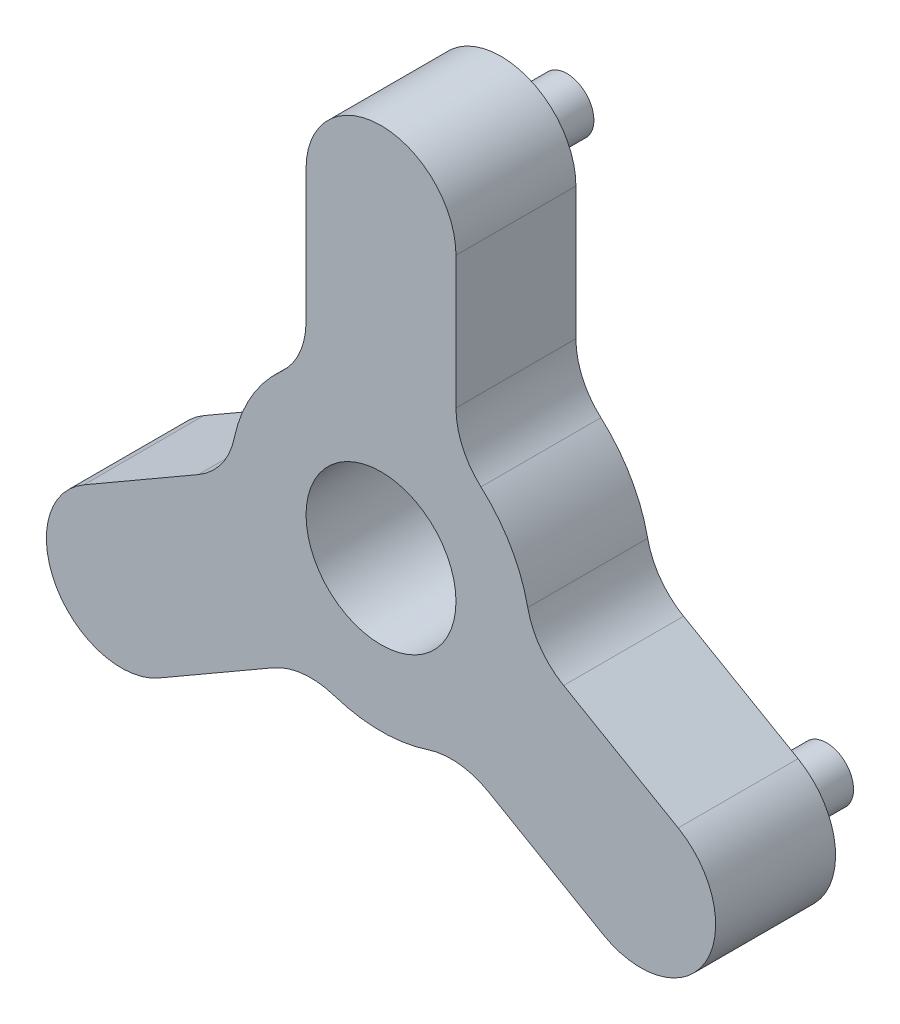
ISO-10303-21;
HEADER;
FILE_DESCRIPTION(('STEP AP214'),'2;1');
FILE_NAME('part.step','',(''),(''),'','','');
FILE_SCHEMA(('AUTOMOTIVE_DESIGN { 1 0 10303 214 1 1 1 1 }'));
ENDSEC;
DATA;
#1=APPLICATION_CONTEXT('core data for automotive mechanical design processes');
#2=APPLICATION_PROTOCOL_DEFINITION('international standard','automotive_design',2000,#1);
#3=PRODUCT_CONTEXT('',#1,'mechanical');
#4=PRODUCT('Part','Part','',(#3));
#5=PRODUCT_RELATED_PRODUCT_CATEGORY('part','',(#4));
#6=PRODUCT_DEFINITION_FORMATION('','',#4);
#7=PRODUCT_DEFINITION_CONTEXT('part definition',#1,'design');
#8=PRODUCT_DEFINITION('design','',#6,#7);
#9=PRODUCT_DEFINITION_SHAPE('','',#8);
#10=(LENGTH_UNIT() NAMED_UNIT(*) SI_UNIT(.MILLI.,.METRE.));
#11=(NAMED_UNIT(*) PLANE_ANGLE_UNIT() SI_UNIT($,.RADIAN.));
#12=(NAMED_UNIT(*) SI_UNIT($,.STERADIAN.) SOLID_ANGLE_UNIT());
#13=UNCERTAINTY_MEASURE_WITH_UNIT(LENGTH_MEASURE(1.E-05),#10,'distance_accuracy_value','');
#14=(GEOMETRIC_REPRESENTATION_CONTEXT(3) GLOBAL_UNCERTAINTY_ASSIGNED_CONTEXT((#13)) GLOBAL_UNIT_ASSIGNED_CONTEXT((#10,
#11,#12)) REPRESENTATION_CONTEXT('',''));
#15=CARTESIAN_POINT('',(0.,0.,0.));
#16=DIRECTION('',(0.,0.,1.));
#17=DIRECTION('',(1.,0.,0.));
#18=AXIS2_PLACEMENT_3D('',#15,#16,#17);
#19=CARTESIAN_POINT('',(0.,44.45,14.1140775589406));
#20=DIRECTION('',(0.,0.,-1.));
#21=DIRECTION('',(-1.,0.,0.));
#22=AXIS2_PLACEMENT_3D('',#19,#20,#21);
#23=CYLINDRICAL_SURFACE('',#22,11.1125);
#24=CARTESIAN_POINT('',(0.,44.45,-3.66592244105941));
#25=DIRECTION('',(0.,0.,1.));
#26=DIRECTION('',(1.,0.,0.));
#27=AXIS2_PLACEMENT_3D('',#24,#25,#26);
#28=CIRCLE('',#27,11.1125);
#29=CARTESIAN_POINT('',(11.1125,44.45,-3.66592244105941));
#30=VERTEX_POINT('',#29);
#31=CARTESIAN_POINT('',(-11.1125,44.45,-3.66592244105941));
#32=VERTEX_POINT('',#31);
#33=EDGE_CURVE('E192',#30,#32,#28,.T.);
#34=ORIENTED_EDGE('',*,*,#33,.T.);
#35=DIRECTION('',(0.,0.,-1.));
#36=VECTOR('',#35,1.);
#37=CARTESIAN_POINT('',(-11.1125,44.45,14.1140775589406));
#38=LINE('',#37,#36);
#39=CARTESIAN_POINT('',(-11.1125,44.45,14.1140775589406));
#40=VERTEX_POINT('',#39);
#41=EDGE_CURVE('E270',#40,#32,#38,.T.);
#42=ORIENTED_EDGE('',*,*,#41,.F.);
#43=CARTESIAN_POINT('',(0.,44.45,14.1140775589406));
#44=DIRECTION('',(0.,0.,1.));
#45=DIRECTION('',(1.,0.,0.));
#46=AXIS2_PLACEMENT_3D('',#43,#44,#45);
#47=CIRCLE('',#46,11.1125);
#48=CARTESIAN_POINT('',(11.1125,44.45,14.1140775589406));
#49=VERTEX_POINT('',#48);
#50=EDGE_CURVE('E227',#49,#40,#47,.T.);
#51=ORIENTED_EDGE('',*,*,#50,.F.);
#52=DIRECTION('',(0.,0.,-1.));
#53=VECTOR('',#52,1.);
#54=CARTESIAN_POINT('',(11.1125,44.45,14.1140775589406));
#55=LINE('',#54,#53);
#56=EDGE_CURVE('E188',#49,#30,#55,.T.);
#57=ORIENTED_EDGE('',*,*,#56,.T.);
#58=EDGE_LOOP('',(#34,#42,#51,#57));
#59=FACE_BOUND('',#58,.T.);
#60=ADVANCED_FACE('F35',(#59),#23,.T.);
#61=CARTESIAN_POINT('',(-11.1125,44.45,14.1140775589406));
#62=DIRECTION('',(1.,0.,0.));
#63=DIRECTION('',(0.,1.,0.));
#64=AXIS2_PLACEMENT_3D('',#61,#62,#63);
#65=PLANE('',#64);
#66=DIRECTION('',(0.,-1.,0.));
#67=VECTOR('',#66,1.);
#68=CARTESIAN_POINT('',(-11.1125,44.45,-3.66592244105941));
#69=LINE('',#68,#67);
#70=CARTESIAN_POINT('',(-11.1125,24.8483053999664,-3.66592244105941));
#71=VERTEX_POINT('',#70);
#72=EDGE_CURVE('E195',#32,#71,#69,.T.);
#73=ORIENTED_EDGE('',*,*,#72,.T.);
#74=DIRECTION('',(0.,0.,-1.));
#75=VECTOR('',#74,1.);
#76=CARTESIAN_POINT('',(-11.1125,24.8483053999664,14.1140775589406));
#77=LINE('',#76,#75);
#78=CARTESIAN_POINT('',(-11.1125,24.8483053999664,14.1140775589406));
#79=VERTEX_POINT('',#78);
#80=EDGE_CURVE('E267',#79,#71,#77,.T.);
#81=ORIENTED_EDGE('',*,*,#80,.F.);
#82=DIRECTION('',(0.,-1.,0.));
#83=VECTOR('',#82,1.);
#84=CARTESIAN_POINT('',(-11.1125,44.45,14.1140775589406));
#85=LINE('',#84,#83);
#86=EDGE_CURVE('E125',#40,#79,#85,.T.);
#87=ORIENTED_EDGE('',*,*,#86,.F.);
#88=ORIENTED_EDGE('',*,*,#41,.T.);
#89=EDGE_LOOP('',(#73,#81,#87,#88));
#90=FACE_BOUND('',#89,.T.);
#91=ADVANCED_FACE('F303',(#90),#65,.F.);
#92=CARTESIAN_POINT('',(-22.225,24.8483053999664,14.1140775589406));
#93=DIRECTION('',(0.,0.,-1.));
#94=DIRECTION('',(-1.,0.,0.));
#95=AXIS2_PLACEMENT_3D('',#92,#93,#94);
#96=CYLINDRICAL_SURFACE('',#95,11.1125);
#97=CARTESIAN_POINT('',(-22.225,24.8483053999664,-3.66592244105941));
#98=DIRECTION('',(0.,0.,-1.));
#99=DIRECTION('',(-1.,0.,0.));
#100=AXIS2_PLACEMENT_3D('',#97,#98,#99);
#101=CIRCLE('',#100,11.1125);
#102=CARTESIAN_POINT('',(-14.8166666666667,16.565536933311,-3.66592244105941));
#103=VERTEX_POINT('',#102);
#104=EDGE_CURVE('E198',#71,#103,#101,.T.);
#105=ORIENTED_EDGE('',*,*,#104,.T.);
#106=DIRECTION('',(0.,0.,-1.));
#107=VECTOR('',#106,1.);
#108=CARTESIAN_POINT('',(-14.8166666666667,16.565536933311,14.1140775589406));
#109=LINE('',#108,#107);
#110=CARTESIAN_POINT('',(-14.8166666666667,16.565536933311,14.1140775589406));
#111=VERTEX_POINT('',#110);
#112=EDGE_CURVE('E264',#111,#103,#109,.T.);
#113=ORIENTED_EDGE('',*,*,#112,.F.);
#114=CARTESIAN_POINT('',(-22.225,24.8483053999664,14.1140775589406));
#115=DIRECTION('',(0.,0.,-1.));
#116=DIRECTION('',(-1.,0.,0.));
#117=AXIS2_PLACEMENT_3D('',#114,#115,#116);
#118=CIRCLE('',#117,11.1125);
#119=EDGE_CURVE('E479',#79,#111,#118,.T.);
#120=ORIENTED_EDGE('',*,*,#119,.F.);
#121=ORIENTED_EDGE('',*,*,#80,.T.);
#122=EDGE_LOOP('',(#105,#113,#120,#121));
#123=FACE_BOUND('',#122,.T.);
#124=ADVANCED_FACE('F307',(#123),#96,.F.);
#125=CARTESIAN_POINT('',(0.,0.,14.1140775589406));
#126=DIRECTION('',(0.,0.,-1.));
#127=DIRECTION('',(-1.,0.,0.));
#128=AXIS2_PLACEMENT_3D('',#125,#126,#127);
#129=CYLINDRICAL_SURFACE('',#128,22.225);
#130=CARTESIAN_POINT('',(0.,0.,-3.66592244105941));
#131=DIRECTION('',(0.,0.,1.));
#132=DIRECTION('',(1.,0.,0.));
#133=AXIS2_PLACEMENT_3D('',#130,#131,#132);
#134=CIRCLE('',#133,22.225);
#135=CARTESIAN_POINT('',(-21.75450914491,4.54884126608397,-3.66592244105941));
#136=VERTEX_POINT('',#135);
#137=EDGE_CURVE('E200',#103,#136,#134,.T.);
#138=ORIENTED_EDGE('',*,*,#137,.T.);
#139=DIRECTION('',(0.,0.,-1.));
#140=VECTOR('',#139,1.);
#141=CARTESIAN_POINT('',(-21.75450914491,4.54884126608397,14.1140775589406));
#142=LINE('',#141,#140);
#143=CARTESIAN_POINT('',(-21.75450914491,4.54884126608397,14.1140775589406));
#144=VERTEX_POINT('',#143);
#145=EDGE_CURVE('E261',#144,#136,#142,.T.);
#146=ORIENTED_EDGE('',*,*,#145,.F.);
#147=CARTESIAN_POINT('',(0.,0.,14.1140775589406));
#148=DIRECTION('',(0.,0.,1.));
#149=DIRECTION('',(1.,0.,0.));
#150=AXIS2_PLACEMENT_3D('',#147,#148,#149);
#151=CIRCLE('',#150,22.225);
#152=EDGE_CURVE('E481',#111,#144,#151,.T.);
#153=ORIENTED_EDGE('',*,*,#152,.F.);
#154=ORIENTED_EDGE('',*,*,#112,.T.);
#155=EDGE_LOOP('',(#138,#146,#153,#154));
#156=FACE_BOUND('',#155,.T.);
#157=ADVANCED_FACE('F311',(#156),#129,.T.);
#158=CARTESIAN_POINT('',(-32.631763717365,6.82326189912595,14.1140775589406));
#159=DIRECTION('',(0.,0.,-1.));
#160=DIRECTION('',(-1.,0.,0.));
#161=AXIS2_PLACEMENT_3D('',#158,#159,#160);
#162=CYLINDRICAL_SURFACE('',#161,11.1125);
#163=CARTESIAN_POINT('',(-32.631763717365,6.82326189912595,-3.66592244105941));
#164=DIRECTION('',(0.,0.,-1.));
#165=DIRECTION('',(1.,0.,0.));
#166=AXIS2_PLACEMENT_3D('',#163,#164,#165);
#167=CIRCLE('',#166,11.1125);
#168=CARTESIAN_POINT('',(-27.075513717365,-2.80044540042862,-3.66592244105941));
#169=VERTEX_POINT('',#168);
#170=EDGE_CURVE('E202',#136,#169,#167,.T.);
#171=ORIENTED_EDGE('',*,*,#170,.T.);
#172=DIRECTION('',(0.,0.,-1.));
#173=VECTOR('',#172,1.);
#174=CARTESIAN_POINT('',(-27.075513717365,-2.80044540042862,14.1140775589406));
#175=LINE('',#174,#173);
#176=CARTESIAN_POINT('',(-27.075513717365,-2.80044540042862,14.1140775589406));
#177=VERTEX_POINT('',#176);
#178=EDGE_CURVE('E258',#177,#169,#175,.T.);
#179=ORIENTED_EDGE('',*,*,#178,.F.);
#180=CARTESIAN_POINT('',(-32.631763717365,6.82326189912595,14.1140775589406));
#181=DIRECTION('',(0.,0.,-1.));
#182=DIRECTION('',(1.,0.,0.));
#183=AXIS2_PLACEMENT_3D('',#180,#181,#182);
#184=CIRCLE('',#183,11.1125);
#185=EDGE_CURVE('E483',#144,#177,#184,.T.);
#186=ORIENTED_EDGE('',*,*,#185,.F.);
#187=ORIENTED_EDGE('',*,*,#145,.T.);
#188=EDGE_LOOP('',(#171,#179,#186,#187));
#189=FACE_BOUND('',#188,.T.);
#190=ADVANCED_FACE('F317',(#189),#162,.F.);
#191=CARTESIAN_POINT('',(-44.0510791982183,-12.6012927004454,14.1140775589406));
#192=DIRECTION('',(0.5,-0.866025403784438,0.));
#193=DIRECTION('',(0.866025403784438,0.500000000000001,0.));
#194=AXIS2_PLACEMENT_3D('',#191,#192,#193);
#195=PLANE('',#194);
#196=DIRECTION('',(-0.866025403784438,-0.5,0.));
#197=VECTOR('',#196,1.);
#198=CARTESIAN_POINT('',(-44.0510791982183,-12.6012927004454,-3.66592244105941));
#199=LINE('',#198,#197);
#200=CARTESIAN_POINT('',(-44.0510791982183,-12.6012927004454,-3.66592244105941));
#201=VERTEX_POINT('',#200);
#202=EDGE_CURVE('E204',#169,#201,#199,.T.);
#203=ORIENTED_EDGE('',*,*,#202,.T.);
#204=DIRECTION('',(0.,0.,-1.));
#205=VECTOR('',#204,1.);
#206=CARTESIAN_POINT('',(-44.0510791982183,-12.6012927004454,14.1140775589406));
#207=LINE('',#206,#205);
#208=CARTESIAN_POINT('',(-44.0510791982183,-12.6012927004454,14.1140775589406));
#209=VERTEX_POINT('',#208);
#210=EDGE_CURVE('E255',#209,#201,#207,.T.);
#211=ORIENTED_EDGE('',*,*,#210,.F.);
#212=DIRECTION('',(-0.866025403784438,-0.5,0.));
#213=VECTOR('',#212,1.);
#214=CARTESIAN_POINT('',(-44.0510791982183,-12.6012927004454,14.1140775589406));
#215=LINE('',#214,#213);
#216=EDGE_CURVE('E485',#177,#209,#215,.T.);
#217=ORIENTED_EDGE('',*,*,#216,.F.);
#218=ORIENTED_EDGE('',*,*,#178,.T.);
#219=EDGE_LOOP('',(#203,#211,#217,#218));
#220=FACE_BOUND('',#219,.T.);
#221=ADVANCED_FACE('F321',(#220),#195,.F.);
#222=CARTESIAN_POINT('',(-38.4948291982183,-22.225,14.1140775589406));
#223=DIRECTION('',(0.,0.,-1.));
#224=DIRECTION('',(-1.,0.,0.));
#225=AXIS2_PLACEMENT_3D('',#222,#223,#224);
#226=CYLINDRICAL_SURFACE('',#225,11.1125);
#227=CARTESIAN_POINT('',(-38.4948291982183,-22.225,-3.66592244105941));
#228=DIRECTION('',(0.,0.,1.));
#229=DIRECTION('',(1.,0.,0.));
#230=AXIS2_PLACEMENT_3D('',#227,#228,#229);
#231=CIRCLE('',#230,11.1125);
#232=CARTESIAN_POINT('',(-32.9385791982183,-31.8487072995546,-3.66592244105941));
#233=VERTEX_POINT('',#232);
#234=EDGE_CURVE('E206',#201,#233,#231,.T.);
#235=ORIENTED_EDGE('',*,*,#234,.T.);
#236=DIRECTION('',(0.,0.,-1.));
#237=VECTOR('',#236,1.);
#238=CARTESIAN_POINT('',(-32.9385791982183,-31.8487072995546,14.1140775589406));
#239=LINE('',#238,#237);
#240=CARTESIAN_POINT('',(-32.9385791982183,-31.8487072995546,14.1140775589406));
#241=VERTEX_POINT('',#240);
#242=EDGE_CURVE('E252',#241,#233,#239,.T.);
#243=ORIENTED_EDGE('',*,*,#242,.F.);
#244=CARTESIAN_POINT('',(-38.4948291982183,-22.225,14.1140775589406));
#245=DIRECTION('',(0.,0.,1.));
#246=DIRECTION('',(1.,0.,0.));
#247=AXIS2_PLACEMENT_3D('',#244,#245,#246);
#248=CIRCLE('',#247,11.1125);
#249=EDGE_CURVE('E487',#209,#241,#248,.T.);
#250=ORIENTED_EDGE('',*,*,#249,.F.);
#251=ORIENTED_EDGE('',*,*,#210,.T.);
#252=EDGE_LOOP('',(#235,#243,#250,#251));
#253=FACE_BOUND('',#252,.T.);
#254=ADVANCED_FACE('F325',(#253),#226,.T.);
#255=CARTESIAN_POINT('',(-32.9385791982183,-31.8487072995546,14.1140775589406));
#256=DIRECTION('',(-0.500000000000001,0.866025403784438,0.));
#257=DIRECTION('',(-0.866025403784438,-0.500000000000001,0.));
#258=AXIS2_PLACEMENT_3D('',#255,#256,#257);
#259=PLANE('',#258);
#260=DIRECTION('',(0.866025403784438,0.500000000000001,0.));
#261=VECTOR('',#260,1.);
#262=CARTESIAN_POINT('',(-32.9385791982183,-31.8487072995546,-3.66592244105941));
#263=LINE('',#262,#261);
#264=CARTESIAN_POINT('',(-15.963013717365,-22.0478599995378,-3.66592244105941));
#265=VERTEX_POINT('',#264);
#266=EDGE_CURVE('E208',#233,#265,#263,.T.);
#267=ORIENTED_EDGE('',*,*,#266,.T.);
#268=DIRECTION('',(0.,0.,-1.));
#269=VECTOR('',#268,1.);
#270=CARTESIAN_POINT('',(-15.963013717365,-22.0478599995378,14.1140775589406));
#271=LINE('',#270,#269);
#272=CARTESIAN_POINT('',(-15.963013717365,-22.0478599995378,14.1140775589406));
#273=VERTEX_POINT('',#272);
#274=EDGE_CURVE('E249',#273,#265,#271,.T.);
#275=ORIENTED_EDGE('',*,*,#274,.F.);
#276=DIRECTION('',(0.866025403784438,0.500000000000001,0.));
#277=VECTOR('',#276,1.);
#278=CARTESIAN_POINT('',(-32.9385791982183,-31.8487072995546,14.1140775589406));
#279=LINE('',#278,#277);
#280=EDGE_CURVE('E489',#241,#273,#279,.T.);
#281=ORIENTED_EDGE('',*,*,#280,.F.);
#282=ORIENTED_EDGE('',*,*,#242,.T.);
#283=EDGE_LOOP('',(#267,#275,#281,#282));
#284=FACE_BOUND('',#283,.T.);
#285=ADVANCED_FACE('F329',(#284),#259,.F.);
#286=CARTESIAN_POINT('',(-10.4067637173649,-31.6715672990923,14.1140775589406));
#287=DIRECTION('',(0.,0.,-1.));
#288=DIRECTION('',(-1.,0.,0.));
#289=AXIS2_PLACEMENT_3D('',#286,#287,#288);
#290=CYLINDRICAL_SURFACE('',#289,11.1125);
#291=CARTESIAN_POINT('',(-10.4067637173649,-31.6715672990923,-3.66592244105941));
#292=DIRECTION('',(0.,0.,-1.));
#293=DIRECTION('',(-1.,0.,0.));
#294=AXIS2_PLACEMENT_3D('',#291,#292,#293);
#295=CIRCLE('',#294,11.1125);
#296=CARTESIAN_POINT('',(-6.93784247824331,-21.1143781993949,-3.66592244105941));
#297=VERTEX_POINT('',#296);
#298=EDGE_CURVE('E210',#265,#297,#295,.T.);
#299=ORIENTED_EDGE('',*,*,#298,.T.);
#300=DIRECTION('',(0.,0.,-1.));
#301=VECTOR('',#300,1.);
#302=CARTESIAN_POINT('',(-6.93784247824331,-21.1143781993949,14.1140775589406));
#303=LINE('',#302,#301);
#304=CARTESIAN_POINT('',(-6.93784247824331,-21.1143781993949,14.1140775589406));
#305=VERTEX_POINT('',#304);
#306=EDGE_CURVE('E246',#305,#297,#303,.T.);
#307=ORIENTED_EDGE('',*,*,#306,.F.);
#308=CARTESIAN_POINT('',(-10.4067637173649,-31.6715672990923,14.1140775589406));
#309=DIRECTION('',(0.,0.,-1.));
#310=DIRECTION('',(-1.,0.,0.));
#311=AXIS2_PLACEMENT_3D('',#308,#309,#310);
#312=CIRCLE('',#311,11.1125);
#313=EDGE_CURVE('E491',#273,#305,#312,.T.);
#314=ORIENTED_EDGE('',*,*,#313,.F.);
#315=ORIENTED_EDGE('',*,*,#274,.T.);
#316=EDGE_LOOP('',(#299,#307,#314,#315));
#317=FACE_BOUND('',#316,.T.);
#318=ADVANCED_FACE('F333',(#317),#290,.F.);
#319=CARTESIAN_POINT('',(0.,0.,14.1140775589406));
#320=DIRECTION('',(0.,0.,-1.));
#321=DIRECTION('',(-1.,0.,0.));
#322=AXIS2_PLACEMENT_3D('',#319,#320,#321);
#323=CYLINDRICAL_SURFACE('',#322,22.225);
#324=CARTESIAN_POINT('',(0.,0.,-3.66592244105941));
#325=DIRECTION('',(0.,0.,1.));
#326=DIRECTION('',(1.,0.,0.));
#327=AXIS2_PLACEMENT_3D('',#324,#325,#326);
#328=CIRCLE('',#327,22.225);
#329=CARTESIAN_POINT('',(6.9378424782433,-21.1143781993949,-3.66592244105941));
#330=VERTEX_POINT('',#329);
#331=EDGE_CURVE('E212',#297,#330,#328,.T.);
#332=ORIENTED_EDGE('',*,*,#331,.T.);
#333=DIRECTION('',(0.,0.,-1.));
#334=VECTOR('',#333,1.);
#335=CARTESIAN_POINT('',(6.9378424782433,-21.1143781993949,14.1140775589406));
#336=LINE('',#335,#334);
#337=CARTESIAN_POINT('',(6.9378424782433,-21.1143781993949,14.1140775589406));
#338=VERTEX_POINT('',#337);
#339=EDGE_CURVE('E243',#338,#330,#336,.T.);
#340=ORIENTED_EDGE('',*,*,#339,.F.);
#341=CARTESIAN_POINT('',(0.,0.,14.1140775589406));
#342=DIRECTION('',(0.,0.,1.));
#343=DIRECTION('',(1.,0.,0.));
#344=AXIS2_PLACEMENT_3D('',#341,#342,#343);
#345=CIRCLE('',#344,22.225);
#346=EDGE_CURVE('E493',#305,#338,#345,.T.);
#347=ORIENTED_EDGE('',*,*,#346,.F.);
#348=ORIENTED_EDGE('',*,*,#306,.T.);
#349=EDGE_LOOP('',(#332,#340,#347,#348));
#350=FACE_BOUND('',#349,.T.);
#351=ADVANCED_FACE('F337',(#350),#323,.T.);
#352=CARTESIAN_POINT('',(10.4067637173649,-31.6715672990923,14.1140775589406));
#353=DIRECTION('',(0.,0.,-1.));
#354=DIRECTION('',(-1.,0.,0.));
#355=AXIS2_PLACEMENT_3D('',#352,#353,#354);
#356=CYLINDRICAL_SURFACE('',#355,11.1125);
#357=CARTESIAN_POINT('',(10.4067637173649,-31.6715672990923,-3.66592244105941));
#358=DIRECTION('',(0.,0.,-1.));
#359=DIRECTION('',(1.,0.,0.));
#360=AXIS2_PLACEMENT_3D('',#357,#358,#359);
#361=CIRCLE('',#360,11.1125);
#362=CARTESIAN_POINT('',(15.9630137173649,-22.0478599995377,-3.66592244105941));
#363=VERTEX_POINT('',#362);
#364=EDGE_CURVE('E214',#330,#363,#361,.T.);
#365=ORIENTED_EDGE('',*,*,#364,.T.);
#366=DIRECTION('',(0.,0.,-1.));
#367=VECTOR('',#366,1.);
#368=CARTESIAN_POINT('',(15.9630137173649,-22.0478599995377,14.1140775589406));
#369=LINE('',#368,#367);
#370=CARTESIAN_POINT('',(15.9630137173649,-22.0478599995377,14.1140775589406));
#371=VERTEX_POINT('',#370);
#372=EDGE_CURVE('E240',#371,#363,#369,.T.);
#373=ORIENTED_EDGE('',*,*,#372,.F.);
#374=CARTESIAN_POINT('',(10.4067637173649,-31.6715672990923,14.1140775589406));
#375=DIRECTION('',(0.,0.,-1.));
#376=DIRECTION('',(1.,0.,0.));
#377=AXIS2_PLACEMENT_3D('',#374,#375,#376);
#378=CIRCLE('',#377,11.1125);
#379=EDGE_CURVE('E495',#338,#371,#378,.T.);
#380=ORIENTED_EDGE('',*,*,#379,.F.);
#381=ORIENTED_EDGE('',*,*,#339,.T.);
#382=EDGE_LOOP('',(#365,#373,#380,#381));
#383=FACE_BOUND('',#382,.T.);
#384=ADVANCED_FACE('F341',(#383),#356,.F.);
#385=CARTESIAN_POINT('',(32.9385791982183,-31.8487072995546,14.1140775589406));
#386=DIRECTION('',(0.5,0.866025403784439,0.));
#387=DIRECTION('',(-0.866025403784439,0.5,0.));
#388=AXIS2_PLACEMENT_3D('',#385,#386,#387);
#389=PLANE('',#388);
#390=DIRECTION('',(0.866025403784439,-0.5,0.));
#391=VECTOR('',#390,1.);
#392=CARTESIAN_POINT('',(32.9385791982183,-31.8487072995546,-3.66592244105941));
#393=LINE('',#392,#391);
#394=CARTESIAN_POINT('',(32.9385791982183,-31.8487072995545,-3.66592244105941));
#395=VERTEX_POINT('',#394);
#396=EDGE_CURVE('E216',#363,#395,#393,.T.);
#397=ORIENTED_EDGE('',*,*,#396,.T.);
#398=DIRECTION('',(0.,0.,-1.));
#399=VECTOR('',#398,1.);
#400=CARTESIAN_POINT('',(32.9385791982183,-31.8487072995545,14.1140775589406));
#401=LINE('',#400,#399);
#402=CARTESIAN_POINT('',(32.9385791982183,-31.8487072995545,14.1140775589406));
#403=VERTEX_POINT('',#402);
#404=EDGE_CURVE('E237',#403,#395,#401,.T.);
#405=ORIENTED_EDGE('',*,*,#404,.F.);
#406=DIRECTION('',(0.866025403784439,-0.5,0.));
#407=VECTOR('',#406,1.);
#408=CARTESIAN_POINT('',(32.9385791982183,-31.8487072995546,14.1140775589406));
#409=LINE('',#408,#407);
#410=EDGE_CURVE('E497',#371,#403,#409,.T.);
#411=ORIENTED_EDGE('',*,*,#410,.F.);
#412=ORIENTED_EDGE('',*,*,#372,.T.);
#413=EDGE_LOOP('',(#397,#405,#411,#412));
#414=FACE_BOUND('',#413,.T.);
#415=ADVANCED_FACE('F345',(#414),#389,.F.);
#416=CARTESIAN_POINT('',(38.4948291982183,-22.225,14.1140775589406));
#417=DIRECTION('',(0.,0.,-1.));
#418=DIRECTION('',(-1.,0.,0.));
#419=AXIS2_PLACEMENT_3D('',#416,#417,#418);
#420=CYLINDRICAL_SURFACE('',#419,11.1125);
#421=CARTESIAN_POINT('',(38.4948291982183,-22.225,-3.66592244105941));
#422=DIRECTION('',(0.,0.,1.));
#423=DIRECTION('',(1.,0.,0.));
#424=AXIS2_PLACEMENT_3D('',#421,#422,#423);
#425=CIRCLE('',#424,11.1125);
#426=CARTESIAN_POINT('',(44.0510791982183,-12.6012927004454,-3.66592244105941));
#427=VERTEX_POINT('',#426);
#428=EDGE_CURVE('E218',#395,#427,#425,.T.);
#429=ORIENTED_EDGE('',*,*,#428,.T.);
#430=DIRECTION('',(0.,0.,-1.));
#431=VECTOR('',#430,1.);
#432=CARTESIAN_POINT('',(44.0510791982183,-12.6012927004454,14.1140775589406));
#433=LINE('',#432,#431);
#434=CARTESIAN_POINT('',(44.0510791982183,-12.6012927004454,14.1140775589406));
#435=VERTEX_POINT('',#434);
#436=EDGE_CURVE('E234',#435,#427,#433,.T.);
#437=ORIENTED_EDGE('',*,*,#436,.F.);
#438=CARTESIAN_POINT('',(38.4948291982183,-22.225,14.1140775589406));
#439=DIRECTION('',(0.,0.,1.));
#440=DIRECTION('',(1.,0.,0.));
#441=AXIS2_PLACEMENT_3D('',#438,#439,#440);
#442=CIRCLE('',#441,11.1125);
#443=EDGE_CURVE('E499',#403,#435,#442,.T.);
#444=ORIENTED_EDGE('',*,*,#443,.F.);
#445=ORIENTED_EDGE('',*,*,#404,.T.);
#446=EDGE_LOOP('',(#429,#437,#444,#445));
#447=FACE_BOUND('',#446,.T.);
#448=ADVANCED_FACE('F349',(#447),#420,.T.);
#449=CARTESIAN_POINT('',(44.0510791982183,-12.6012927004454,14.1140775589406));
#450=DIRECTION('',(-0.5,-0.866025403784439,0.));
#451=DIRECTION('',(0.866025403784439,-0.5,0.));
#452=AXIS2_PLACEMENT_3D('',#449,#450,#451);
#453=PLANE('',#452);
#454=DIRECTION('',(-0.866025403784439,0.5,0.));
#455=VECTOR('',#454,1.);
#456=CARTESIAN_POINT('',(44.0510791982183,-12.6012927004454,-3.66592244105941));
#457=LINE('',#456,#455);
#458=CARTESIAN_POINT('',(27.075513717365,-2.8004454004286,-3.66592244105941));
#459=VERTEX_POINT('',#458);
#460=EDGE_CURVE('E220',#427,#459,#457,.T.);
#461=ORIENTED_EDGE('',*,*,#460,.T.);
#462=DIRECTION('',(0.,0.,-1.));
#463=VECTOR('',#462,1.);
#464=CARTESIAN_POINT('',(27.075513717365,-2.8004454004286,14.1140775589406));
#465=LINE('',#464,#463);
#466=CARTESIAN_POINT('',(27.075513717365,-2.8004454004286,14.1140775589406));
#467=VERTEX_POINT('',#466);
#468=EDGE_CURVE('E231',#467,#459,#465,.T.);
#469=ORIENTED_EDGE('',*,*,#468,.F.);
#470=DIRECTION('',(-0.866025403784439,0.5,0.));
#471=VECTOR('',#470,1.);
#472=CARTESIAN_POINT('',(44.0510791982183,-12.6012927004454,14.1140775589406));
#473=LINE('',#472,#471);
#474=EDGE_CURVE('E501',#435,#467,#473,.T.);
#475=ORIENTED_EDGE('',*,*,#474,.F.);
#476=ORIENTED_EDGE('',*,*,#436,.T.);
#477=EDGE_LOOP('',(#461,#469,#475,#476));
#478=FACE_BOUND('',#477,.T.);
#479=ADVANCED_FACE('F353',(#478),#453,.F.);
#480=CARTESIAN_POINT('',(32.6317637173649,6.82326189912598,14.1140775589406));
#481=DIRECTION('',(0.,0.,-1.));
#482=DIRECTION('',(-1.,0.,0.));
#483=AXIS2_PLACEMENT_3D('',#480,#481,#482);
#484=CYLINDRICAL_SURFACE('',#483,11.1125);
#485=CARTESIAN_POINT('',(32.6317637173649,6.82326189912598,-3.66592244105941));
#486=DIRECTION('',(0.,0.,-1.));
#487=DIRECTION('',(-1.,0.,0.));
#488=AXIS2_PLACEMENT_3D('',#485,#486,#487);
#489=CIRCLE('',#488,11.1125);
#490=CARTESIAN_POINT('',(21.75450914491,4.54884126608399,-3.66592244105941));
#491=VERTEX_POINT('',#490);
#492=EDGE_CURVE('E222',#459,#491,#489,.T.);
#493=ORIENTED_EDGE('',*,*,#492,.T.);
#494=DIRECTION('',(0.,0.,-1.));
#495=VECTOR('',#494,1.);
#496=CARTESIAN_POINT('',(21.75450914491,4.54884126608399,14.1140775589406));
#497=LINE('',#496,#495);
#498=CARTESIAN_POINT('',(21.75450914491,4.54884126608399,14.1140775589406));
#499=VERTEX_POINT('',#498);
#500=EDGE_CURVE('E183',#499,#491,#497,.T.);
#501=ORIENTED_EDGE('',*,*,#500,.F.);
#502=CARTESIAN_POINT('',(32.6317637173649,6.82326189912598,14.1140775589406));
#503=DIRECTION('',(0.,0.,-1.));
#504=DIRECTION('',(-1.,0.,0.));
#505=AXIS2_PLACEMENT_3D('',#502,#503,#504);
#506=CIRCLE('',#505,11.1125);
#507=EDGE_CURVE('E174',#467,#499,#506,.T.);
#508=ORIENTED_EDGE('',*,*,#507,.F.);
#509=ORIENTED_EDGE('',*,*,#468,.T.);
#510=EDGE_LOOP('',(#493,#501,#508,#509));
#511=FACE_BOUND('',#510,.T.);
#512=ADVANCED_FACE('F357',(#511),#484,.F.);
#513=CARTESIAN_POINT('',(0.,0.,14.1140775589406));
#514=DIRECTION('',(0.,0.,-1.));
#515=DIRECTION('',(-1.,0.,0.));
#516=AXIS2_PLACEMENT_3D('',#513,#514,#515);
#517=CYLINDRICAL_SURFACE('',#516,22.225);
#518=CARTESIAN_POINT('',(0.,0.,-3.66592244105941));
#519=DIRECTION('',(0.,0.,1.));
#520=DIRECTION('',(1.,0.,0.));
#521=AXIS2_PLACEMENT_3D('',#518,#519,#520);
#522=CIRCLE('',#521,22.225);
#523=CARTESIAN_POINT('',(14.8166666666667,16.565536933311,-3.66592244105941));
#524=VERTEX_POINT('',#523);
#525=EDGE_CURVE('E182',#491,#524,#522,.T.);
#526=ORIENTED_EDGE('',*,*,#525,.T.);
#527=DIRECTION('',(0.,0.,-1.));
#528=VECTOR('',#527,1.);
#529=CARTESIAN_POINT('',(14.8166666666667,16.565536933311,14.1140775589406));
#530=LINE('',#529,#528);
#531=CARTESIAN_POINT('',(14.8166666666667,16.565536933311,14.1140775589406));
#532=VERTEX_POINT('',#531);
#533=EDGE_CURVE('E179',#532,#524,#530,.T.);
#534=ORIENTED_EDGE('',*,*,#533,.F.);
#535=CARTESIAN_POINT('',(0.,0.,14.1140775589406));
#536=DIRECTION('',(0.,0.,1.));
#537=DIRECTION('',(1.,0.,0.));
#538=AXIS2_PLACEMENT_3D('',#535,#536,#537);
#539=CIRCLE('',#538,22.225);
#540=EDGE_CURVE('E168',#499,#532,#539,.T.);
#541=ORIENTED_EDGE('',*,*,#540,.F.);
#542=ORIENTED_EDGE('',*,*,#500,.T.);
#543=EDGE_LOOP('',(#526,#534,#541,#542));
#544=FACE_BOUND('',#543,.T.);
#545=ADVANCED_FACE('F180',(#544),#517,.T.);
#546=CARTESIAN_POINT('',(22.225,24.8483053999664,14.1140775589406));
#547=DIRECTION('',(0.,0.,-1.));
#548=DIRECTION('',(-1.,0.,0.));
#549=AXIS2_PLACEMENT_3D('',#546,#547,#548);
#550=CYLINDRICAL_SURFACE('',#549,11.1125);
#551=CARTESIAN_POINT('',(22.225,24.8483053999664,-3.66592244105941));
#552=DIRECTION('',(0.,0.,-1.));
#553=DIRECTION('',(1.,0.,0.));
#554=AXIS2_PLACEMENT_3D('',#551,#552,#553);
#555=CIRCLE('',#554,11.1125);
#556=CARTESIAN_POINT('',(11.1125,24.8483053999664,-3.66592244105941));
#557=VERTEX_POINT('',#556);
#558=EDGE_CURVE('E110',#524,#557,#555,.T.);
#559=ORIENTED_EDGE('',*,*,#558,.T.);
#560=DIRECTION('',(0.,0.,-1.));
#561=VECTOR('',#560,1.);
#562=CARTESIAN_POINT('',(11.1125,24.8483053999664,14.1140775589406));
#563=LINE('',#562,#561);
#564=CARTESIAN_POINT('',(11.1125,24.8483053999664,14.1140775589406));
#565=VERTEX_POINT('',#564);
#566=EDGE_CURVE('E184',#565,#557,#563,.T.);
#567=ORIENTED_EDGE('',*,*,#566,.F.);
#568=CARTESIAN_POINT('',(22.225,24.8483053999664,14.1140775589406));
#569=DIRECTION('',(0.,0.,-1.));
#570=DIRECTION('',(1.,0.,0.));
#571=AXIS2_PLACEMENT_3D('',#568,#569,#570);
#572=CIRCLE('',#571,11.1125);
#573=EDGE_CURVE('E172',#532,#565,#572,.T.);
#574=ORIENTED_EDGE('',*,*,#573,.F.);
#575=ORIENTED_EDGE('',*,*,#533,.T.);
#576=EDGE_LOOP('',(#559,#567,#574,#575));
#577=FACE_BOUND('',#576,.T.);
#578=ADVANCED_FACE('F186',(#577),#550,.F.);
#579=CARTESIAN_POINT('',(11.1125,44.45,14.1140775589406));
#580=DIRECTION('',(-1.,0.,0.));
#581=DIRECTION('',(0.,-1.,0.));
#582=AXIS2_PLACEMENT_3D('',#579,#580,#581);
#583=PLANE('',#582);
#584=DIRECTION('',(0.,1.,0.));
#585=VECTOR('',#584,1.);
#586=CARTESIAN_POINT('',(11.1125,44.45,-3.66592244105941));
#587=LINE('',#586,#585);
#588=EDGE_CURVE('E116',#557,#30,#587,.T.);
#589=ORIENTED_EDGE('',*,*,#588,.T.);
#590=ORIENTED_EDGE('',*,*,#56,.F.);
#591=DIRECTION('',(0.,1.,0.));
#592=VECTOR('',#591,1.);
#593=CARTESIAN_POINT('',(11.1125,44.45,14.1140775589406));
#594=LINE('',#593,#592);
#595=EDGE_CURVE('E51',#565,#49,#594,.T.);
#596=ORIENTED_EDGE('',*,*,#595,.F.);
#597=ORIENTED_EDGE('',*,*,#566,.T.);
#598=EDGE_LOOP('',(#589,#590,#596,#597));
#599=FACE_BOUND('',#598,.T.);
#600=ADVANCED_FACE('F292',(#599),#583,.F.);
#601=CARTESIAN_POINT('',(0.,44.45,14.1140775589406));
#602=DIRECTION('',(0.,0.,1.));
#603=DIRECTION('',(1.,0.,0.));
#604=AXIS2_PLACEMENT_3D('',#601,#602,#603);
#605=PLANE('',#604);
#606=CARTESIAN_POINT('',(0.,0.,14.1140775589406));
#607=DIRECTION('',(0.,0.,1.));
#608=DIRECTION('',(1.,0.,0.));
#609=AXIS2_PLACEMENT_3D('',#606,#607,#608);
#610=CIRCLE('',#609,11.1125);
#611=CARTESIAN_POINT('',(11.1125,0.,14.1140775589406));
#612=VERTEX_POINT('',#611);
#613=EDGE_CURVE('E465',#612,#612,#610,.F.);
#614=ORIENTED_EDGE('',*,*,#613,.T.);
#615=EDGE_LOOP('',(#614));
#616=FACE_BOUND('',#615,.T.);
#617=ORIENTED_EDGE('',*,*,#50,.T.);
#618=ORIENTED_EDGE('',*,*,#86,.T.);
#619=ORIENTED_EDGE('',*,*,#119,.T.);
#620=ORIENTED_EDGE('',*,*,#152,.T.);
#621=ORIENTED_EDGE('',*,*,#185,.T.);
#622=ORIENTED_EDGE('',*,*,#216,.T.);
#623=ORIENTED_EDGE('',*,*,#249,.T.);
#624=ORIENTED_EDGE('',*,*,#280,.T.);
#625=ORIENTED_EDGE('',*,*,#313,.T.);
#626=ORIENTED_EDGE('',*,*,#346,.T.);
#627=ORIENTED_EDGE('',*,*,#379,.T.);
#628=ORIENTED_EDGE('',*,*,#410,.T.);
#629=ORIENTED_EDGE('',*,*,#443,.T.);
#630=ORIENTED_EDGE('',*,*,#474,.T.);
#631=ORIENTED_EDGE('',*,*,#507,.T.);
#632=ORIENTED_EDGE('',*,*,#540,.T.);
#633=ORIENTED_EDGE('',*,*,#573,.T.);
#634=ORIENTED_EDGE('',*,*,#595,.T.);
#635=EDGE_LOOP('',(#617,#618,#619,#620,#621,#622,#623,#624,#625,#626,#627,#628,#629,#630,#631,
#632,#633,#634));
#636=FACE_BOUND('',#635,.T.);
#637=ADVANCED_FACE('F170',(#616,#636),#605,.T.);
#638=CARTESIAN_POINT('',(0.,44.45,-3.66592244105941));
#639=DIRECTION('',(0.,0.,1.));
#640=DIRECTION('',(1.,0.,0.));
#641=AXIS2_PLACEMENT_3D('',#638,#639,#640);
#642=PLANE('',#641);
#643=CARTESIAN_POINT('',(0.,0.,-3.66592244105941));
#644=DIRECTION('',(0.,0.,-1.));
#645=DIRECTION('',(-1.,0.,0.));
#646=AXIS2_PLACEMENT_3D('',#643,#644,#645);
#647=CIRCLE('',#646,11.1125);
#648=CARTESIAN_POINT('',(-11.1125,0.,-3.66592244105941));
#649=VERTEX_POINT('',#648);
#650=EDGE_CURVE('E462',#649,#649,#647,.T.);
#651=ORIENTED_EDGE('',*,*,#650,.F.);
#652=EDGE_LOOP('',(#651));
#653=FACE_BOUND('',#652,.T.);
#654=CARTESIAN_POINT('',(38.4948291982183,-22.225,-3.66592244105941));
#655=DIRECTION('',(0.,0.,1.));
#656=DIRECTION('',(1.,0.,0.));
#657=AXIS2_PLACEMENT_3D('',#654,#655,#656);
#658=CIRCLE('',#657,3.99998882500037);
#659=CARTESIAN_POINT('',(42.4948180232187,-22.225,-3.66592244105941));
#660=VERTEX_POINT('',#659);
#661=EDGE_CURVE('E11',#660,#660,#658,.F.);
#662=ORIENTED_EDGE('',*,*,#661,.F.);
#663=EDGE_LOOP('',(#662));
#664=FACE_BOUND('',#663,.T.);
#665=CARTESIAN_POINT('',(-38.4948291982183,-22.225,-3.66592244105941));
#666=DIRECTION('',(0.,0.,1.));
#667=DIRECTION('',(1.,0.,0.));
#668=AXIS2_PLACEMENT_3D('',#665,#666,#667);
#669=CIRCLE('',#668,3.99998882500021);
#670=CARTESIAN_POINT('',(-34.4948403732181,-22.225,-3.66592244105941));
#671=VERTEX_POINT('',#670);
#672=EDGE_CURVE('E43',#671,#671,#669,.F.);
#673=ORIENTED_EDGE('',*,*,#672,.F.);
#674=EDGE_LOOP('',(#673));
#675=FACE_BOUND('',#674,.T.);
#676=CARTESIAN_POINT('',(0.,44.45,-3.66592244105941));
#677=DIRECTION('',(0.,0.,1.));
#678=DIRECTION('',(1.,0.,0.));
#679=AXIS2_PLACEMENT_3D('',#676,#677,#678);
#680=CIRCLE('',#679,3.999988825);
#681=CARTESIAN_POINT('',(3.99998882499999,44.45,-3.66592244105941));
#682=VERTEX_POINT('',#681);
#683=EDGE_CURVE('E272',#682,#682,#680,.F.);
#684=ORIENTED_EDGE('',*,*,#683,.F.);
#685=EDGE_LOOP('',(#684));
#686=FACE_BOUND('',#685,.T.);
#687=ORIENTED_EDGE('',*,*,#33,.F.);
#688=ORIENTED_EDGE('',*,*,#588,.F.);
#689=ORIENTED_EDGE('',*,*,#558,.F.);
#690=ORIENTED_EDGE('',*,*,#525,.F.);
#691=ORIENTED_EDGE('',*,*,#492,.F.);
#692=ORIENTED_EDGE('',*,*,#460,.F.);
#693=ORIENTED_EDGE('',*,*,#428,.F.);
#694=ORIENTED_EDGE('',*,*,#396,.F.);
#695=ORIENTED_EDGE('',*,*,#364,.F.);
#696=ORIENTED_EDGE('',*,*,#331,.F.);
#697=ORIENTED_EDGE('',*,*,#298,.F.);
#698=ORIENTED_EDGE('',*,*,#266,.F.);
#699=ORIENTED_EDGE('',*,*,#234,.F.);
#700=ORIENTED_EDGE('',*,*,#202,.F.);
#701=ORIENTED_EDGE('',*,*,#170,.F.);
#702=ORIENTED_EDGE('',*,*,#137,.F.);
#703=ORIENTED_EDGE('',*,*,#104,.F.);
#704=ORIENTED_EDGE('',*,*,#72,.F.);
#705=EDGE_LOOP('',(#687,#688,#689,#690,#691,#692,#693,#694,#695,#696,#697,#698,#699,#700,#701,
#702,#703,#704));
#706=FACE_BOUND('',#705,.T.);
#707=ADVANCED_FACE('F279',(#653,#664,#675,#686,#706),#642,.F.);
#708=CARTESIAN_POINT('',(0.,44.45,-13.4449224410594));
#709=DIRECTION('',(0.,0.,1.));
#710=DIRECTION('',(1.,0.,0.));
#711=AXIS2_PLACEMENT_3D('',#708,#709,#710);
#712=CYLINDRICAL_SURFACE('',#711,3.999988825);
#713=CARTESIAN_POINT('',(0.,44.45,-13.4449224410594));
#714=DIRECTION('',(0.,0.,-1.));
#715=DIRECTION('',(-1.,0.,0.));
#716=AXIS2_PLACEMENT_3D('',#713,#714,#715);
#717=CIRCLE('',#716,3.999988825);
#718=CARTESIAN_POINT('',(-3.99998882500001,44.45,-13.4449224410594));
#719=VERTEX_POINT('',#718);
#720=EDGE_CURVE('E196',#719,#719,#717,.T.);
#721=ORIENTED_EDGE('',*,*,#720,.F.);
#722=EDGE_LOOP('',(#721));
#723=FACE_BOUND('',#722,.T.);
#724=ORIENTED_EDGE('',*,*,#683,.T.);
#725=EDGE_LOOP('',(#724));
#726=FACE_BOUND('',#725,.T.);
#727=ADVANCED_FACE('F282',(#723,#726),#712,.T.);
#728=CARTESIAN_POINT('',(0.,44.45,-13.4449224410594));
#729=DIRECTION('',(0.,0.,-1.));
#730=DIRECTION('',(-1.,0.,0.));
#731=AXIS2_PLACEMENT_3D('',#728,#729,#730);
#732=PLANE('',#731);
#733=ORIENTED_EDGE('',*,*,#720,.T.);
#734=EDGE_LOOP('',(#733));
#735=FACE_BOUND('',#734,.T.);
#736=ADVANCED_FACE('F396',(#735),#732,.T.);
#737=CARTESIAN_POINT('',(-38.4948291982183,-22.225,-13.4449224410594));
#738=DIRECTION('',(0.,0.,1.));
#739=DIRECTION('',(1.,0.,0.));
#740=AXIS2_PLACEMENT_3D('',#737,#738,#739);
#741=CYLINDRICAL_SURFACE('',#740,3.99998882500021);
#742=CARTESIAN_POINT('',(-38.4948291982183,-22.225,-13.4449224410594));
#743=DIRECTION('',(0.,0.,-1.));
#744=DIRECTION('',(-1.,0.,0.));
#745=AXIS2_PLACEMENT_3D('',#742,#743,#744);
#746=CIRCLE('',#745,3.99998882500021);
#747=CARTESIAN_POINT('',(-42.4948180232185,-22.225,-13.4449224410594));
#748=VERTEX_POINT('',#747);
#749=EDGE_CURVE('E469',#748,#748,#746,.T.);
#750=ORIENTED_EDGE('',*,*,#749,.F.);
#751=EDGE_LOOP('',(#750));
#752=FACE_BOUND('',#751,.T.);
#753=ORIENTED_EDGE('',*,*,#672,.T.);
#754=EDGE_LOOP('',(#753));
#755=FACE_BOUND('',#754,.T.);
#756=ADVANCED_FACE('F277',(#752,#755),#741,.T.);
#757=CARTESIAN_POINT('',(-38.4948291982183,-22.225,-13.4449224410594));
#758=DIRECTION('',(0.,0.,-1.));
#759=DIRECTION('',(-1.,0.,0.));
#760=AXIS2_PLACEMENT_3D('',#757,#758,#759);
#761=PLANE('',#760);
#762=ORIENTED_EDGE('',*,*,#749,.T.);
#763=EDGE_LOOP('',(#762));
#764=FACE_BOUND('',#763,.T.);
#765=ADVANCED_FACE('F415',(#764),#761,.T.);
#766=CARTESIAN_POINT('',(38.4948291982183,-22.225,-13.4449224410594));
#767=DIRECTION('',(0.,0.,1.));
#768=DIRECTION('',(1.,0.,0.));
#769=AXIS2_PLACEMENT_3D('',#766,#767,#768);
#770=CYLINDRICAL_SURFACE('',#769,3.99998882500037);
#771=CARTESIAN_POINT('',(38.4948291982183,-22.225,-13.4449224410594));
#772=DIRECTION('',(0.,0.,-1.));
#773=DIRECTION('',(-1.,0.,0.));
#774=AXIS2_PLACEMENT_3D('',#771,#772,#773);
#775=CIRCLE('',#774,3.99998882500037);
#776=CARTESIAN_POINT('',(34.4948403732179,-22.225,-13.4449224410594));
#777=VERTEX_POINT('',#776);
#778=EDGE_CURVE('E466',#777,#777,#775,.T.);
#779=ORIENTED_EDGE('',*,*,#778,.F.);
#780=EDGE_LOOP('',(#779));
#781=FACE_BOUND('',#780,.T.);
#782=ORIENTED_EDGE('',*,*,#661,.T.);
#783=EDGE_LOOP('',(#782));
#784=FACE_BOUND('',#783,.T.);
#785=ADVANCED_FACE('F425',(#781,#784),#770,.T.);
#786=CARTESIAN_POINT('',(38.4948291982183,-22.225,-13.4449224410594));
#787=DIRECTION('',(0.,0.,-1.));
#788=DIRECTION('',(-1.,0.,0.));
#789=AXIS2_PLACEMENT_3D('',#786,#787,#788);
#790=PLANE('',#789);
#791=ORIENTED_EDGE('',*,*,#778,.T.);
#792=EDGE_LOOP('',(#791));
#793=FACE_BOUND('',#792,.T.);
#794=ADVANCED_FACE('F435',(#793),#790,.T.);
#795=CARTESIAN_POINT('',(0.,0.,45.5449739826826));
#796=DIRECTION('',(0.,0.,-1.));
#797=DIRECTION('',(-1.,0.,0.));
#798=AXIS2_PLACEMENT_3D('',#795,#796,#797);
#799=CYLINDRICAL_SURFACE('',#798,11.1125);
#800=ORIENTED_EDGE('',*,*,#650,.T.);
#801=EDGE_LOOP('',(#800));
#802=FACE_BOUND('',#801,.T.);
#803=ORIENTED_EDGE('',*,*,#613,.F.);
#804=EDGE_LOOP('',(#803));
#805=FACE_BOUND('',#804,.T.);
#806=ADVANCED_FACE('F445',(#802,#805),#799,.F.);
#807=CLOSED_SHELL('',(#60,#91,#124,#157,#190,#221,#254,#285,#318,#351,#384,#415,#448,#479,#512,
#545,#578,#600,#637,#707,#727,#736,#756,#765,#785,#794,#806));
#808=MANIFOLD_SOLID_BREP('B2',#807);
#809=ADVANCED_BREP_SHAPE_REPRESENTATION('',(#18,#808),#14);
#810=SHAPE_DEFINITION_REPRESENTATION(#9,#809);
ENDSEC;
END-ISO-10303-21;
